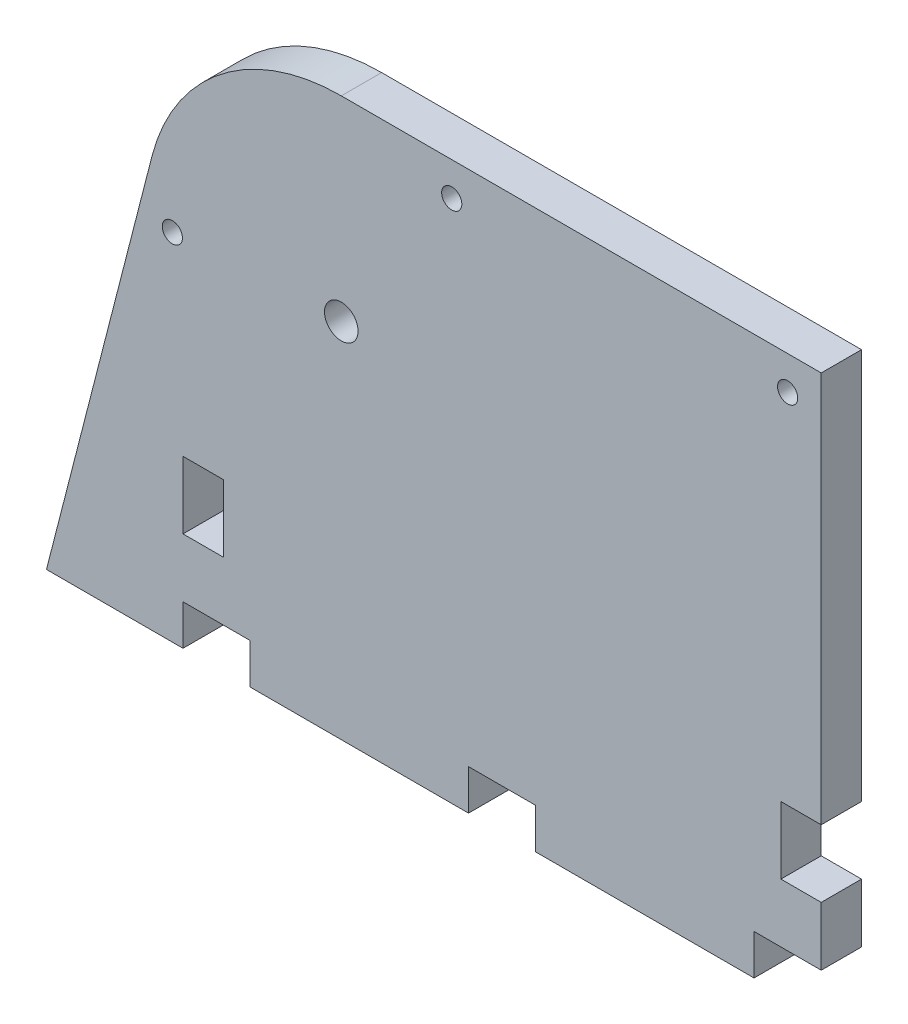
ISO-10303-21;
HEADER;
FILE_DESCRIPTION(('STEP AP214'),'2;1');
FILE_NAME('part.step','',(''),(''),'','','');
FILE_SCHEMA(('AUTOMOTIVE_DESIGN { 1 0 10303 214 1 1 1 1 }'));
ENDSEC;
DATA;
#1=APPLICATION_CONTEXT('core data for automotive mechanical design processes');
#2=APPLICATION_PROTOCOL_DEFINITION('international standard','automotive_design',2000,#1);
#3=PRODUCT_CONTEXT('',#1,'mechanical');
#4=PRODUCT('Part','Part','',(#3));
#5=PRODUCT_RELATED_PRODUCT_CATEGORY('part','',(#4));
#6=PRODUCT_DEFINITION_FORMATION('','',#4);
#7=PRODUCT_DEFINITION_CONTEXT('part definition',#1,'design');
#8=PRODUCT_DEFINITION('design','',#6,#7);
#9=PRODUCT_DEFINITION_SHAPE('','',#8);
#10=(LENGTH_UNIT() NAMED_UNIT(*) SI_UNIT(.MILLI.,.METRE.));
#11=(NAMED_UNIT(*) PLANE_ANGLE_UNIT() SI_UNIT($,.RADIAN.));
#12=(NAMED_UNIT(*) SI_UNIT($,.STERADIAN.) SOLID_ANGLE_UNIT());
#13=UNCERTAINTY_MEASURE_WITH_UNIT(LENGTH_MEASURE(1.E-05),#10,'distance_accuracy_value','');
#14=(GEOMETRIC_REPRESENTATION_CONTEXT(3) GLOBAL_UNCERTAINTY_ASSIGNED_CONTEXT((#13)) GLOBAL_UNIT_ASSIGNED_CONTEXT((#10,
#11,#12)) REPRESENTATION_CONTEXT('',''));
#15=CARTESIAN_POINT('',(0.,0.,0.));
#16=DIRECTION('',(0.,0.,1.));
#17=DIRECTION('',(1.,0.,0.));
#18=AXIS2_PLACEMENT_3D('',#15,#16,#17);
#19=CARTESIAN_POINT('',(105.,0.,6.));
#20=DIRECTION('',(0.,1.,0.));
#21=DIRECTION('',(-1.,0.,0.));
#22=AXIS2_PLACEMENT_3D('',#19,#20,#21);
#23=PLANE('',#22);
#24=DIRECTION('',(1.,0.,0.));
#25=VECTOR('',#24,1.);
#26=CARTESIAN_POINT('',(105.,0.,0.));
#27=LINE('',#26,#25);
#28=CARTESIAN_POINT('',(20.,0.,0.));
#29=VERTEX_POINT('',#28);
#30=CARTESIAN_POINT('',(52.5,0.,0.));
#31=VERTEX_POINT('',#30);
#32=EDGE_CURVE('E210',#29,#31,#27,.T.);
#33=ORIENTED_EDGE('',*,*,#32,.T.);
#34=DIRECTION('',(0.,0.,1.));
#35=VECTOR('',#34,1.);
#36=CARTESIAN_POINT('',(52.5,0.,0.));
#37=LINE('',#36,#35);
#38=CARTESIAN_POINT('',(52.5,0.,6.));
#39=VERTEX_POINT('',#38);
#40=EDGE_CURVE('E190',#31,#39,#37,.T.);
#41=ORIENTED_EDGE('',*,*,#40,.T.);
#42=DIRECTION('',(1.,0.,0.));
#43=VECTOR('',#42,1.);
#44=CARTESIAN_POINT('',(105.,0.,6.));
#45=LINE('',#44,#43);
#46=CARTESIAN_POINT('',(20.,0.,6.));
#47=VERTEX_POINT('',#46);
#48=EDGE_CURVE('E273',#47,#39,#45,.T.);
#49=ORIENTED_EDGE('',*,*,#48,.F.);
#50=DIRECTION('',(0.,0.,1.));
#51=VECTOR('',#50,1.);
#52=CARTESIAN_POINT('',(20.,0.,0.));
#53=LINE('',#52,#51);
#54=EDGE_CURVE('E217',#29,#47,#53,.T.);
#55=ORIENTED_EDGE('',*,*,#54,.F.);
#56=EDGE_LOOP('',(#33,#41,#49,#55));
#57=FACE_BOUND('',#56,.T.);
#58=ADVANCED_FACE('F34',(#57),#23,.F.);
#59=CARTESIAN_POINT('',(-10.3247928552616,0.,0.));
#60=VERTEX_POINT('',#59);
#61=CARTESIAN_POINT('',(10.,0.,0.));
#62=VERTEX_POINT('',#61);
#63=EDGE_CURVE('E218',#60,#62,#27,.T.);
#64=ORIENTED_EDGE('',*,*,#63,.T.);
#65=DIRECTION('',(0.,0.,1.));
#66=VECTOR('',#65,1.);
#67=CARTESIAN_POINT('',(10.,0.,0.));
#68=LINE('',#67,#66);
#69=CARTESIAN_POINT('',(10.,0.,6.));
#70=VERTEX_POINT('',#69);
#71=EDGE_CURVE('E269',#62,#70,#68,.T.);
#72=ORIENTED_EDGE('',*,*,#71,.T.);
#73=CARTESIAN_POINT('',(-10.3247928552616,0.,6.));
#74=VERTEX_POINT('',#73);
#75=EDGE_CURVE('E268',#74,#70,#45,.T.);
#76=ORIENTED_EDGE('',*,*,#75,.F.);
#77=DIRECTION('',(0.,0.,-1.));
#78=VECTOR('',#77,1.);
#79=CARTESIAN_POINT('',(-10.3247928552616,0.,6.));
#80=LINE('',#79,#78);
#81=EDGE_CURVE('E239',#74,#60,#80,.T.);
#82=ORIENTED_EDGE('',*,*,#81,.T.);
#83=EDGE_LOOP('',(#64,#72,#76,#82));
#84=FACE_BOUND('',#83,.T.);
#85=ADVANCED_FACE('F265',(#84),#23,.F.);
#86=CARTESIAN_POINT('',(105.,83.,6.));
#87=DIRECTION('',(-1.,0.,0.));
#88=DIRECTION('',(0.,-1.,0.));
#89=AXIS2_PLACEMENT_3D('',#86,#87,#88);
#90=PLANE('',#89);
#91=DIRECTION('',(0.,1.,0.));
#92=VECTOR('',#91,1.);
#93=CARTESIAN_POINT('',(105.,83.,0.));
#94=LINE('',#93,#92);
#95=CARTESIAN_POINT('',(105.,6.00000000000002,0.));
#96=VERTEX_POINT('',#95);
#97=CARTESIAN_POINT('',(105.,14.75,0.));
#98=VERTEX_POINT('',#97);
#99=EDGE_CURVE('E230',#96,#98,#94,.T.);
#100=ORIENTED_EDGE('',*,*,#99,.T.);
#101=DIRECTION('',(0.,0.,1.));
#102=VECTOR('',#101,1.);
#103=CARTESIAN_POINT('',(105.,14.75,0.));
#104=LINE('',#103,#102);
#105=CARTESIAN_POINT('',(105.,14.75,6.));
#106=VERTEX_POINT('',#105);
#107=EDGE_CURVE('E326',#98,#106,#104,.T.);
#108=ORIENTED_EDGE('',*,*,#107,.T.);
#109=DIRECTION('',(0.,1.,0.));
#110=VECTOR('',#109,1.);
#111=CARTESIAN_POINT('',(105.,83.,6.));
#112=LINE('',#111,#110);
#113=CARTESIAN_POINT('',(105.,6.,6.));
#114=VERTEX_POINT('',#113);
#115=EDGE_CURVE('E275',#114,#106,#112,.T.);
#116=ORIENTED_EDGE('',*,*,#115,.F.);
#117=DIRECTION('',(0.,0.,1.));
#118=VECTOR('',#117,1.);
#119=CARTESIAN_POINT('',(105.,6.,0.));
#120=LINE('',#119,#118);
#121=EDGE_CURVE('E298',#96,#114,#120,.T.);
#122=ORIENTED_EDGE('',*,*,#121,.F.);
#123=EDGE_LOOP('',(#100,#108,#116,#122));
#124=FACE_BOUND('',#123,.T.);
#125=ADVANCED_FACE('F407',(#124),#90,.F.);
#126=CARTESIAN_POINT('',(33.5613886077065,53.9097221037271,6.));
#127=DIRECTION('',(0.,0.,-1.));
#128=DIRECTION('',(-1.,0.,0.));
#129=AXIS2_PLACEMENT_3D('',#126,#127,#128);
#130=PLANE('',#129);
#131=CARTESIAN_POINT('',(8.41486022586607,52.8440056136108,6.));
#132=DIRECTION('',(0.,0.,-1.));
#133=DIRECTION('',(-1.,0.,0.));
#134=AXIS2_PLACEMENT_3D('',#131,#132,#133);
#135=CIRCLE('',#134,1.5);
#136=CARTESIAN_POINT('',(9.91486022586607,52.8440056136108,6.));
#137=VERTEX_POINT('',#136);
#138=EDGE_CURVE('E473',#137,#137,#135,.F.);
#139=ORIENTED_EDGE('',*,*,#138,.F.);
#140=EDGE_LOOP('',(#139));
#141=FACE_BOUND('',#140,.T.);
#142=CARTESIAN_POINT('',(50.,78.,6.));
#143=DIRECTION('',(0.,0.,1.));
#144=DIRECTION('',(1.,0.,0.));
#145=AXIS2_PLACEMENT_3D('',#142,#143,#144);
#146=CIRCLE('',#145,1.5);
#147=CARTESIAN_POINT('',(51.5,78.,6.));
#148=VERTEX_POINT('',#147);
#149=EDGE_CURVE('E476',#148,#148,#146,.T.);
#150=ORIENTED_EDGE('',*,*,#149,.F.);
#151=EDGE_LOOP('',(#150));
#152=FACE_BOUND('',#151,.T.);
#153=CARTESIAN_POINT('',(100.,78.,6.));
#154=DIRECTION('',(0.,0.,1.));
#155=DIRECTION('',(1.,0.,0.));
#156=AXIS2_PLACEMENT_3D('',#153,#154,#155);
#157=CIRCLE('',#156,1.5);
#158=CARTESIAN_POINT('',(101.5,78.,6.));
#159=VERTEX_POINT('',#158);
#160=EDGE_CURVE('E469',#159,#159,#157,.T.);
#161=ORIENTED_EDGE('',*,*,#160,.F.);
#162=EDGE_LOOP('',(#161));
#163=FACE_BOUND('',#162,.T.);
#164=DIRECTION('',(1.,0.,0.));
#165=VECTOR('',#164,1.);
#166=CARTESIAN_POINT('',(10.,14.75,6.));
#167=LINE('',#166,#165);
#168=CARTESIAN_POINT('',(10.,14.75,6.));
#169=VERTEX_POINT('',#168);
#170=CARTESIAN_POINT('',(16.,14.75,6.));
#171=VERTEX_POINT('',#170);
#172=EDGE_CURVE('E347',#169,#171,#167,.T.);
#173=ORIENTED_EDGE('',*,*,#172,.F.);
#174=DIRECTION('',(0.,-1.,0.));
#175=VECTOR('',#174,1.);
#176=CARTESIAN_POINT('',(10.,14.75,6.));
#177=LINE('',#176,#175);
#178=CARTESIAN_POINT('',(10.,24.75,6.));
#179=VERTEX_POINT('',#178);
#180=EDGE_CURVE('E50',#179,#169,#177,.T.);
#181=ORIENTED_EDGE('',*,*,#180,.F.);
#182=DIRECTION('',(-1.,0.,0.));
#183=VECTOR('',#182,1.);
#184=CARTESIAN_POINT('',(10.,24.75,6.));
#185=LINE('',#184,#183);
#186=CARTESIAN_POINT('',(16.,24.75,6.));
#187=VERTEX_POINT('',#186);
#188=EDGE_CURVE('E338',#187,#179,#185,.T.);
#189=ORIENTED_EDGE('',*,*,#188,.F.);
#190=DIRECTION('',(0.,1.,0.));
#191=VECTOR('',#190,1.);
#192=CARTESIAN_POINT('',(16.,14.75,6.));
#193=LINE('',#192,#191);
#194=EDGE_CURVE('E351',#171,#187,#193,.T.);
#195=ORIENTED_EDGE('',*,*,#194,.F.);
#196=EDGE_LOOP('',(#173,#181,#189,#195));
#197=FACE_BOUND('',#196,.T.);
#198=ORIENTED_EDGE('',*,*,#115,.T.);
#199=DIRECTION('',(1.,0.,0.));
#200=VECTOR('',#199,1.);
#201=CARTESIAN_POINT('',(105.,14.75,6.));
#202=LINE('',#201,#200);
#203=CARTESIAN_POINT('',(99.,14.75,6.));
#204=VERTEX_POINT('',#203);
#205=EDGE_CURVE('E312',#204,#106,#202,.T.);
#206=ORIENTED_EDGE('',*,*,#205,.F.);
#207=DIRECTION('',(0.,-1.,0.));
#208=VECTOR('',#207,1.);
#209=CARTESIAN_POINT('',(99.,24.75,6.));
#210=LINE('',#209,#208);
#211=CARTESIAN_POINT('',(99.,24.75,6.));
#212=VERTEX_POINT('',#211);
#213=EDGE_CURVE('E321',#212,#204,#210,.T.);
#214=ORIENTED_EDGE('',*,*,#213,.F.);
#215=DIRECTION('',(-1.,0.,0.));
#216=VECTOR('',#215,1.);
#217=CARTESIAN_POINT('',(105.,24.75,6.));
#218=LINE('',#217,#216);
#219=CARTESIAN_POINT('',(105.,24.75,6.));
#220=VERTEX_POINT('',#219);
#221=EDGE_CURVE('E318',#220,#212,#218,.T.);
#222=ORIENTED_EDGE('',*,*,#221,.F.);
#223=CARTESIAN_POINT('',(105.,83.,6.));
#224=VERTEX_POINT('',#223);
#225=EDGE_CURVE('E272',#220,#224,#112,.T.);
#226=ORIENTED_EDGE('',*,*,#225,.T.);
#227=DIRECTION('',(-1.,0.,0.));
#228=VECTOR('',#227,1.);
#229=CARTESIAN_POINT('',(33.5613886077065,83.,6.));
#230=LINE('',#229,#228);
#231=CARTESIAN_POINT('',(33.5613886077065,83.,6.));
#232=VERTEX_POINT('',#231);
#233=EDGE_CURVE('E431',#224,#232,#230,.T.);
#234=ORIENTED_EDGE('',*,*,#233,.T.);
#235=CARTESIAN_POINT('',(33.5613886077065,53.9097221037271,6.));
#236=DIRECTION('',(0.,0.,1.));
#237=DIRECTION('',(-1.,0.,0.));
#238=AXIS2_PLACEMENT_3D('',#235,#236,#237);
#239=CIRCLE('',#238,29.0902778962729);
#240=CARTESIAN_POINT('',(5.38622005558548,61.1487928411874,6.));
#241=VERTEX_POINT('',#240);
#242=EDGE_CURVE('E252',#232,#241,#239,.T.);
#243=ORIENTED_EDGE('',*,*,#242,.T.);
#244=DIRECTION('',(-0.248848455943689,-0.968542433750035,0.));
#245=VECTOR('',#244,1.);
#246=CARTESIAN_POINT('',(-9.68542433750036,2.48848455943689,6.));
#247=LINE('',#246,#245);
#248=EDGE_CURVE('E227',#241,#74,#247,.T.);
#249=ORIENTED_EDGE('',*,*,#248,.T.);
#250=ORIENTED_EDGE('',*,*,#75,.T.);
#251=DIRECTION('',(0.,-1.,0.));
#252=VECTOR('',#251,1.);
#253=CARTESIAN_POINT('',(10.,0.,6.));
#254=LINE('',#253,#252);
#255=CARTESIAN_POINT('',(10.,6.,6.));
#256=VERTEX_POINT('',#255);
#257=EDGE_CURVE('E370',#256,#70,#254,.T.);
#258=ORIENTED_EDGE('',*,*,#257,.F.);
#259=DIRECTION('',(-1.,0.,0.));
#260=VECTOR('',#259,1.);
#261=CARTESIAN_POINT('',(10.,6.,6.));
#262=LINE('',#261,#260);
#263=CARTESIAN_POINT('',(20.,6.,6.));
#264=VERTEX_POINT('',#263);
#265=EDGE_CURVE('E365',#264,#256,#262,.T.);
#266=ORIENTED_EDGE('',*,*,#265,.F.);
#267=DIRECTION('',(0.,1.,0.));
#268=VECTOR('',#267,1.);
#269=CARTESIAN_POINT('',(20.,0.,6.));
#270=LINE('',#269,#268);
#271=EDGE_CURVE('E372',#47,#264,#270,.T.);
#272=ORIENTED_EDGE('',*,*,#271,.F.);
#273=ORIENTED_EDGE('',*,*,#48,.T.);
#274=DIRECTION('',(0.,-1.,0.));
#275=VECTOR('',#274,1.);
#276=CARTESIAN_POINT('',(52.5,0.,6.));
#277=LINE('',#276,#275);
#278=CARTESIAN_POINT('',(52.5,6.,6.));
#279=VERTEX_POINT('',#278);
#280=EDGE_CURVE('E196',#279,#39,#277,.T.);
#281=ORIENTED_EDGE('',*,*,#280,.F.);
#282=DIRECTION('',(-1.,0.,0.));
#283=VECTOR('',#282,1.);
#284=CARTESIAN_POINT('',(52.5,6.,6.));
#285=LINE('',#284,#283);
#286=CARTESIAN_POINT('',(62.5,6.,6.));
#287=VERTEX_POINT('',#286);
#288=EDGE_CURVE('E214',#287,#279,#285,.T.);
#289=ORIENTED_EDGE('',*,*,#288,.F.);
#290=DIRECTION('',(0.,1.,0.));
#291=VECTOR('',#290,1.);
#292=CARTESIAN_POINT('',(62.5,0.,6.));
#293=LINE('',#292,#291);
#294=CARTESIAN_POINT('',(62.5,0.,6.));
#295=VERTEX_POINT('',#294);
#296=EDGE_CURVE('E289',#295,#287,#293,.T.);
#297=ORIENTED_EDGE('',*,*,#296,.F.);
#298=CARTESIAN_POINT('',(95.,0.,6.));
#299=VERTEX_POINT('',#298);
#300=EDGE_CURVE('E238',#295,#299,#45,.T.);
#301=ORIENTED_EDGE('',*,*,#300,.T.);
#302=DIRECTION('',(0.,-1.,0.));
#303=VECTOR('',#302,1.);
#304=CARTESIAN_POINT('',(95.,0.,6.));
#305=LINE('',#304,#303);
#306=CARTESIAN_POINT('',(95.,6.,6.));
#307=VERTEX_POINT('',#306);
#308=EDGE_CURVE('E286',#307,#299,#305,.T.);
#309=ORIENTED_EDGE('',*,*,#308,.F.);
#310=DIRECTION('',(-1.,0.,0.));
#311=VECTOR('',#310,1.);
#312=CARTESIAN_POINT('',(95.,6.,6.));
#313=LINE('',#312,#311);
#314=EDGE_CURVE('E452',#114,#307,#313,.T.);
#315=ORIENTED_EDGE('',*,*,#314,.F.);
#316=EDGE_LOOP('',(#198,#206,#214,#222,#226,#234,#243,#249,#250,#258,#266,#272,#273,#281,#289,
#297,#301,#309,#315));
#317=FACE_BOUND('',#316,.T.);
#318=CARTESIAN_POINT('',(33.5613886077065,53.9097221037271,6.));
#319=DIRECTION('',(0.,0.,1.));
#320=DIRECTION('',(1.,0.,0.));
#321=AXIS2_PLACEMENT_3D('',#318,#319,#320);
#322=CIRCLE('',#321,2.5);
#323=CARTESIAN_POINT('',(36.0613886077065,53.9097221037271,6.));
#324=VERTEX_POINT('',#323);
#325=EDGE_CURVE('E224',#324,#324,#322,.T.);
#326=ORIENTED_EDGE('',*,*,#325,.F.);
#327=EDGE_LOOP('',(#326));
#328=FACE_BOUND('',#327,.T.);
#329=ADVANCED_FACE('F283',(#141,#152,#163,#197,#317,#328),#130,.F.);
#330=CARTESIAN_POINT('',(33.5613886077065,53.9097221037271,0.));
#331=DIRECTION('',(0.,0.,-1.));
#332=DIRECTION('',(-1.,0.,0.));
#333=AXIS2_PLACEMENT_3D('',#330,#331,#332);
#334=PLANE('',#333);
#335=CARTESIAN_POINT('',(8.41486022586607,52.8440056136108,0.));
#336=DIRECTION('',(0.,0.,-1.));
#337=DIRECTION('',(-1.,0.,0.));
#338=AXIS2_PLACEMENT_3D('',#335,#336,#337);
#339=CIRCLE('',#338,1.5);
#340=CARTESIAN_POINT('',(9.91486022586607,52.8440056136108,0.));
#341=VERTEX_POINT('',#340);
#342=EDGE_CURVE('E38',#341,#341,#339,.F.);
#343=ORIENTED_EDGE('',*,*,#342,.T.);
#344=EDGE_LOOP('',(#343));
#345=FACE_BOUND('',#344,.T.);
#346=CARTESIAN_POINT('',(50.,78.,0.));
#347=DIRECTION('',(0.,0.,1.));
#348=DIRECTION('',(1.,0.,0.));
#349=AXIS2_PLACEMENT_3D('',#346,#347,#348);
#350=CIRCLE('',#349,1.5);
#351=CARTESIAN_POINT('',(51.5,78.,0.));
#352=VERTEX_POINT('',#351);
#353=EDGE_CURVE('E348',#352,#352,#350,.T.);
#354=ORIENTED_EDGE('',*,*,#353,.T.);
#355=EDGE_LOOP('',(#354));
#356=FACE_BOUND('',#355,.T.);
#357=CARTESIAN_POINT('',(100.,78.,0.));
#358=DIRECTION('',(0.,0.,1.));
#359=DIRECTION('',(1.,0.,0.));
#360=AXIS2_PLACEMENT_3D('',#357,#358,#359);
#361=CIRCLE('',#360,1.5);
#362=CARTESIAN_POINT('',(101.5,78.,0.));
#363=VERTEX_POINT('',#362);
#364=EDGE_CURVE('E472',#363,#363,#361,.T.);
#365=ORIENTED_EDGE('',*,*,#364,.T.);
#366=EDGE_LOOP('',(#365));
#367=FACE_BOUND('',#366,.T.);
#368=DIRECTION('',(0.,-1.,0.));
#369=VECTOR('',#368,1.);
#370=CARTESIAN_POINT('',(10.,14.75,0.));
#371=LINE('',#370,#369);
#372=CARTESIAN_POINT('',(10.,24.75,0.));
#373=VERTEX_POINT('',#372);
#374=CARTESIAN_POINT('',(10.,14.75,0.));
#375=VERTEX_POINT('',#374);
#376=EDGE_CURVE('E334',#373,#375,#371,.T.);
#377=ORIENTED_EDGE('',*,*,#376,.T.);
#378=DIRECTION('',(1.,0.,0.));
#379=VECTOR('',#378,1.);
#380=CARTESIAN_POINT('',(10.,14.75,0.));
#381=LINE('',#380,#379);
#382=CARTESIAN_POINT('',(16.,14.75,0.));
#383=VERTEX_POINT('',#382);
#384=EDGE_CURVE('E337',#375,#383,#381,.T.);
#385=ORIENTED_EDGE('',*,*,#384,.T.);
#386=DIRECTION('',(0.,1.,0.));
#387=VECTOR('',#386,1.);
#388=CARTESIAN_POINT('',(16.,14.75,0.));
#389=LINE('',#388,#387);
#390=CARTESIAN_POINT('',(16.,24.75,0.));
#391=VERTEX_POINT('',#390);
#392=EDGE_CURVE('E58',#383,#391,#389,.T.);
#393=ORIENTED_EDGE('',*,*,#392,.T.);
#394=DIRECTION('',(-1.,0.,0.));
#395=VECTOR('',#394,1.);
#396=CARTESIAN_POINT('',(10.,24.75,0.));
#397=LINE('',#396,#395);
#398=EDGE_CURVE('E342',#391,#373,#397,.T.);
#399=ORIENTED_EDGE('',*,*,#398,.T.);
#400=EDGE_LOOP('',(#377,#385,#393,#399));
#401=FACE_BOUND('',#400,.T.);
#402=DIRECTION('',(1.,0.,0.));
#403=VECTOR('',#402,1.);
#404=CARTESIAN_POINT('',(105.,14.75,0.));
#405=LINE('',#404,#403);
#406=CARTESIAN_POINT('',(99.,14.75,0.));
#407=VERTEX_POINT('',#406);
#408=EDGE_CURVE('E315',#407,#98,#405,.T.);
#409=ORIENTED_EDGE('',*,*,#408,.T.);
#410=ORIENTED_EDGE('',*,*,#99,.F.);
#411=DIRECTION('',(-1.,0.,0.));
#412=VECTOR('',#411,1.);
#413=CARTESIAN_POINT('',(95.,6.,0.));
#414=LINE('',#413,#412);
#415=CARTESIAN_POINT('',(95.,6.,0.));
#416=VERTEX_POINT('',#415);
#417=EDGE_CURVE('E299',#96,#416,#414,.T.);
#418=ORIENTED_EDGE('',*,*,#417,.T.);
#419=DIRECTION('',(0.,-1.,0.));
#420=VECTOR('',#419,1.);
#421=CARTESIAN_POINT('',(95.,0.,0.));
#422=LINE('',#421,#420);
#423=CARTESIAN_POINT('',(95.,0.,0.));
#424=VERTEX_POINT('',#423);
#425=EDGE_CURVE('E304',#416,#424,#422,.T.);
#426=ORIENTED_EDGE('',*,*,#425,.T.);
#427=CARTESIAN_POINT('',(62.5,0.,0.));
#428=VERTEX_POINT('',#427);
#429=EDGE_CURVE('E219',#428,#424,#27,.T.);
#430=ORIENTED_EDGE('',*,*,#429,.F.);
#431=DIRECTION('',(0.,1.,0.));
#432=VECTOR('',#431,1.);
#433=CARTESIAN_POINT('',(62.5,0.,0.));
#434=LINE('',#433,#432);
#435=CARTESIAN_POINT('',(62.5,6.,0.));
#436=VERTEX_POINT('',#435);
#437=EDGE_CURVE('E213',#428,#436,#434,.T.);
#438=ORIENTED_EDGE('',*,*,#437,.T.);
#439=DIRECTION('',(-1.,0.,0.));
#440=VECTOR('',#439,1.);
#441=CARTESIAN_POINT('',(52.5,6.,0.));
#442=LINE('',#441,#440);
#443=CARTESIAN_POINT('',(52.5,6.,0.));
#444=VERTEX_POINT('',#443);
#445=EDGE_CURVE('E202',#436,#444,#442,.T.);
#446=ORIENTED_EDGE('',*,*,#445,.T.);
#447=DIRECTION('',(0.,-1.,0.));
#448=VECTOR('',#447,1.);
#449=CARTESIAN_POINT('',(52.5,0.,0.));
#450=LINE('',#449,#448);
#451=EDGE_CURVE('E193',#444,#31,#450,.T.);
#452=ORIENTED_EDGE('',*,*,#451,.T.);
#453=ORIENTED_EDGE('',*,*,#32,.F.);
#454=DIRECTION('',(0.,1.,0.));
#455=VECTOR('',#454,1.);
#456=CARTESIAN_POINT('',(20.,0.,0.));
#457=LINE('',#456,#455);
#458=CARTESIAN_POINT('',(20.,6.,0.));
#459=VERTEX_POINT('',#458);
#460=EDGE_CURVE('E364',#29,#459,#457,.T.);
#461=ORIENTED_EDGE('',*,*,#460,.T.);
#462=DIRECTION('',(-1.,0.,0.));
#463=VECTOR('',#462,1.);
#464=CARTESIAN_POINT('',(10.,6.,0.));
#465=LINE('',#464,#463);
#466=CARTESIAN_POINT('',(10.,6.,0.));
#467=VERTEX_POINT('',#466);
#468=EDGE_CURVE('E367',#459,#467,#465,.T.);
#469=ORIENTED_EDGE('',*,*,#468,.T.);
#470=DIRECTION('',(0.,-1.,0.));
#471=VECTOR('',#470,1.);
#472=CARTESIAN_POINT('',(10.,0.,0.));
#473=LINE('',#472,#471);
#474=EDGE_CURVE('E362',#467,#62,#473,.T.);
#475=ORIENTED_EDGE('',*,*,#474,.T.);
#476=ORIENTED_EDGE('',*,*,#63,.F.);
#477=DIRECTION('',(-0.24884845594369,-0.968542433750035,0.));
#478=VECTOR('',#477,1.);
#479=CARTESIAN_POINT('',(-9.68542433750036,2.48848455943689,0.));
#480=LINE('',#479,#478);
#481=CARTESIAN_POINT('',(5.38622005558548,61.1487928411874,0.));
#482=VERTEX_POINT('',#481);
#483=EDGE_CURVE('E236',#482,#60,#480,.T.);
#484=ORIENTED_EDGE('',*,*,#483,.F.);
#485=CARTESIAN_POINT('',(33.5613886077065,53.9097221037271,0.));
#486=DIRECTION('',(0.,0.,1.));
#487=DIRECTION('',(-1.,0.,0.));
#488=AXIS2_PLACEMENT_3D('',#485,#486,#487);
#489=CIRCLE('',#488,29.0902778962729);
#490=CARTESIAN_POINT('',(33.5613886077065,83.,0.));
#491=VERTEX_POINT('',#490);
#492=EDGE_CURVE('E233',#491,#482,#489,.T.);
#493=ORIENTED_EDGE('',*,*,#492,.F.);
#494=DIRECTION('',(-1.,0.,0.));
#495=VECTOR('',#494,1.);
#496=CARTESIAN_POINT('',(33.5613886077065,83.,0.));
#497=LINE('',#496,#495);
#498=CARTESIAN_POINT('',(105.,83.,0.));
#499=VERTEX_POINT('',#498);
#500=EDGE_CURVE('E231',#499,#491,#497,.T.);
#501=ORIENTED_EDGE('',*,*,#500,.F.);
#502=CARTESIAN_POINT('',(105.,24.75,0.));
#503=VERTEX_POINT('',#502);
#504=EDGE_CURVE('E222',#503,#499,#94,.T.);
#505=ORIENTED_EDGE('',*,*,#504,.F.);
#506=DIRECTION('',(-1.,0.,0.));
#507=VECTOR('',#506,1.);
#508=CARTESIAN_POINT('',(105.,24.75,0.));
#509=LINE('',#508,#507);
#510=CARTESIAN_POINT('',(99.,24.75,0.));
#511=VERTEX_POINT('',#510);
#512=EDGE_CURVE('E308',#503,#511,#509,.T.);
#513=ORIENTED_EDGE('',*,*,#512,.T.);
#514=DIRECTION('',(0.,-1.,0.));
#515=VECTOR('',#514,1.);
#516=CARTESIAN_POINT('',(99.,24.75,0.));
#517=LINE('',#516,#515);
#518=EDGE_CURVE('E311',#511,#407,#517,.T.);
#519=ORIENTED_EDGE('',*,*,#518,.T.);
#520=EDGE_LOOP('',(#409,#410,#418,#426,#430,#438,#446,#452,#453,#461,#469,#475,#476,#484,#493,
#501,#505,#513,#519));
#521=FACE_BOUND('',#520,.T.);
#522=CARTESIAN_POINT('',(33.5613886077065,53.9097221037271,0.));
#523=DIRECTION('',(0.,0.,1.));
#524=DIRECTION('',(1.,0.,0.));
#525=AXIS2_PLACEMENT_3D('',#522,#523,#524);
#526=CIRCLE('',#525,2.5);
#527=CARTESIAN_POINT('',(36.0613886077065,53.9097221037271,0.));
#528=VERTEX_POINT('',#527);
#529=EDGE_CURVE('E380',#528,#528,#526,.T.);
#530=ORIENTED_EDGE('',*,*,#529,.T.);
#531=EDGE_LOOP('',(#530));
#532=FACE_BOUND('',#531,.T.);
#533=ADVANCED_FACE('F207',(#345,#356,#367,#401,#521,#532),#334,.T.);
#534=ORIENTED_EDGE('',*,*,#429,.T.);
#535=DIRECTION('',(0.,0.,1.));
#536=VECTOR('',#535,1.);
#537=CARTESIAN_POINT('',(95.,0.,0.));
#538=LINE('',#537,#536);
#539=EDGE_CURVE('E294',#424,#299,#538,.T.);
#540=ORIENTED_EDGE('',*,*,#539,.T.);
#541=ORIENTED_EDGE('',*,*,#300,.F.);
#542=DIRECTION('',(0.,0.,1.));
#543=VECTOR('',#542,1.);
#544=CARTESIAN_POINT('',(62.5,0.,0.));
#545=LINE('',#544,#543);
#546=EDGE_CURVE('E201',#428,#295,#545,.T.);
#547=ORIENTED_EDGE('',*,*,#546,.F.);
#548=EDGE_LOOP('',(#534,#540,#541,#547));
#549=FACE_BOUND('',#548,.T.);
#550=ADVANCED_FACE('F36',(#549),#23,.F.);
#551=ORIENTED_EDGE('',*,*,#225,.F.);
#552=DIRECTION('',(0.,0.,1.));
#553=VECTOR('',#552,1.);
#554=CARTESIAN_POINT('',(105.,24.75,0.));
#555=LINE('',#554,#553);
#556=EDGE_CURVE('E317',#503,#220,#555,.T.);
#557=ORIENTED_EDGE('',*,*,#556,.F.);
#558=ORIENTED_EDGE('',*,*,#504,.T.);
#559=DIRECTION('',(0.,0.,-1.));
#560=VECTOR('',#559,1.);
#561=CARTESIAN_POINT('',(105.,83.,6.));
#562=LINE('',#561,#560);
#563=EDGE_CURVE('E11',#224,#499,#562,.T.);
#564=ORIENTED_EDGE('',*,*,#563,.F.);
#565=EDGE_LOOP('',(#551,#557,#558,#564));
#566=FACE_BOUND('',#565,.T.);
#567=ADVANCED_FACE('F409',(#566),#90,.F.);
#568=CARTESIAN_POINT('',(33.5613886077065,83.,6.));
#569=DIRECTION('',(0.,-1.,0.));
#570=DIRECTION('',(0.,0.,-1.));
#571=AXIS2_PLACEMENT_3D('',#568,#569,#570);
#572=PLANE('',#571);
#573=ORIENTED_EDGE('',*,*,#500,.T.);
#574=DIRECTION('',(0.,0.,-1.));
#575=VECTOR('',#574,1.);
#576=CARTESIAN_POINT('',(33.5613886077065,83.,6.));
#577=LINE('',#576,#575);
#578=EDGE_CURVE('E43',#232,#491,#577,.T.);
#579=ORIENTED_EDGE('',*,*,#578,.F.);
#580=ORIENTED_EDGE('',*,*,#233,.F.);
#581=ORIENTED_EDGE('',*,*,#563,.T.);
#582=EDGE_LOOP('',(#573,#579,#580,#581));
#583=FACE_BOUND('',#582,.T.);
#584=ADVANCED_FACE('F414',(#583),#572,.F.);
#585=CARTESIAN_POINT('',(33.5613886077065,53.9097221037271,6.));
#586=DIRECTION('',(0.,0.,-1.));
#587=DIRECTION('',(-1.,0.,0.));
#588=AXIS2_PLACEMENT_3D('',#585,#586,#587);
#589=CYLINDRICAL_SURFACE('',#588,29.0902778962729);
#590=ORIENTED_EDGE('',*,*,#492,.T.);
#591=DIRECTION('',(0.,0.,-1.));
#592=VECTOR('',#591,1.);
#593=CARTESIAN_POINT('',(5.38622005558548,61.1487928411874,6.));
#594=LINE('',#593,#592);
#595=EDGE_CURVE('E242',#241,#482,#594,.T.);
#596=ORIENTED_EDGE('',*,*,#595,.F.);
#597=ORIENTED_EDGE('',*,*,#242,.F.);
#598=ORIENTED_EDGE('',*,*,#578,.T.);
#599=EDGE_LOOP('',(#590,#596,#597,#598));
#600=FACE_BOUND('',#599,.T.);
#601=ADVANCED_FACE('F250',(#600),#589,.T.);
#602=CARTESIAN_POINT('',(-9.68542433750036,2.48848455943689,6.));
#603=DIRECTION('',(0.968542433750035,-0.24884845594369,0.));
#604=DIRECTION('',(0.24884845594369,0.968542433750035,0.));
#605=AXIS2_PLACEMENT_3D('',#602,#603,#604);
#606=PLANE('',#605);
#607=ORIENTED_EDGE('',*,*,#483,.T.);
#608=ORIENTED_EDGE('',*,*,#81,.F.);
#609=ORIENTED_EDGE('',*,*,#248,.F.);
#610=ORIENTED_EDGE('',*,*,#595,.T.);
#611=EDGE_LOOP('',(#607,#608,#609,#610));
#612=FACE_BOUND('',#611,.T.);
#613=ADVANCED_FACE('F261',(#612),#606,.F.);
#614=CARTESIAN_POINT('',(33.5613886077065,53.9097221037271,6.));
#615=DIRECTION('',(0.,0.,-1.));
#616=DIRECTION('',(-1.,0.,0.));
#617=AXIS2_PLACEMENT_3D('',#614,#615,#616);
#618=CYLINDRICAL_SURFACE('',#617,2.5);
#619=ORIENTED_EDGE('',*,*,#325,.T.);
#620=EDGE_LOOP('',(#619));
#621=FACE_BOUND('',#620,.T.);
#622=ORIENTED_EDGE('',*,*,#529,.F.);
#623=EDGE_LOOP('',(#622));
#624=FACE_BOUND('',#623,.T.);
#625=ADVANCED_FACE('F389',(#621,#624),#618,.F.);
#626=CARTESIAN_POINT('',(95.,0.,0.));
#627=DIRECTION('',(-1.,0.,0.));
#628=DIRECTION('',(0.,0.,1.));
#629=AXIS2_PLACEMENT_3D('',#626,#627,#628);
#630=PLANE('',#629);
#631=ORIENTED_EDGE('',*,*,#308,.T.);
#632=ORIENTED_EDGE('',*,*,#539,.F.);
#633=ORIENTED_EDGE('',*,*,#425,.F.);
#634=DIRECTION('',(0.,0.,1.));
#635=VECTOR('',#634,1.);
#636=CARTESIAN_POINT('',(95.,6.,0.));
#637=LINE('',#636,#635);
#638=EDGE_CURVE('E301',#416,#307,#637,.T.);
#639=ORIENTED_EDGE('',*,*,#638,.T.);
#640=EDGE_LOOP('',(#631,#632,#633,#639));
#641=FACE_BOUND('',#640,.T.);
#642=ADVANCED_FACE('F391',(#641),#630,.F.);
#643=CARTESIAN_POINT('',(95.,6.,0.));
#644=DIRECTION('',(0.,1.,0.));
#645=DIRECTION('',(0.,0.,1.));
#646=AXIS2_PLACEMENT_3D('',#643,#644,#645);
#647=PLANE('',#646);
#648=ORIENTED_EDGE('',*,*,#314,.T.);
#649=ORIENTED_EDGE('',*,*,#638,.F.);
#650=ORIENTED_EDGE('',*,*,#417,.F.);
#651=ORIENTED_EDGE('',*,*,#121,.T.);
#652=EDGE_LOOP('',(#648,#649,#650,#651));
#653=FACE_BOUND('',#652,.T.);
#654=ADVANCED_FACE('F398',(#653),#647,.F.);
#655=CARTESIAN_POINT('',(105.,14.75,0.));
#656=DIRECTION('',(0.,-1.,0.));
#657=DIRECTION('',(0.,0.,-1.));
#658=AXIS2_PLACEMENT_3D('',#655,#656,#657);
#659=PLANE('',#658);
#660=ORIENTED_EDGE('',*,*,#205,.T.);
#661=ORIENTED_EDGE('',*,*,#107,.F.);
#662=ORIENTED_EDGE('',*,*,#408,.F.);
#663=DIRECTION('',(0.,0.,1.));
#664=VECTOR('',#663,1.);
#665=CARTESIAN_POINT('',(99.,14.75,0.));
#666=LINE('',#665,#664);
#667=EDGE_CURVE('E329',#407,#204,#666,.T.);
#668=ORIENTED_EDGE('',*,*,#667,.T.);
#669=EDGE_LOOP('',(#660,#661,#662,#668));
#670=FACE_BOUND('',#669,.T.);
#671=ADVANCED_FACE('F444',(#670),#659,.F.);
#672=CARTESIAN_POINT('',(99.,24.75,0.));
#673=DIRECTION('',(-1.,0.,0.));
#674=DIRECTION('',(0.,0.,1.));
#675=AXIS2_PLACEMENT_3D('',#672,#673,#674);
#676=PLANE('',#675);
#677=ORIENTED_EDGE('',*,*,#213,.T.);
#678=ORIENTED_EDGE('',*,*,#667,.F.);
#679=ORIENTED_EDGE('',*,*,#518,.F.);
#680=DIRECTION('',(0.,0.,1.));
#681=VECTOR('',#680,1.);
#682=CARTESIAN_POINT('',(99.,24.75,0.));
#683=LINE('',#682,#681);
#684=EDGE_CURVE('E331',#511,#212,#683,.T.);
#685=ORIENTED_EDGE('',*,*,#684,.T.);
#686=EDGE_LOOP('',(#677,#678,#679,#685));
#687=FACE_BOUND('',#686,.T.);
#688=ADVANCED_FACE('F440',(#687),#676,.F.);
#689=CARTESIAN_POINT('',(105.,24.75,0.));
#690=DIRECTION('',(0.,1.,0.));
#691=DIRECTION('',(0.,0.,1.));
#692=AXIS2_PLACEMENT_3D('',#689,#690,#691);
#693=PLANE('',#692);
#694=ORIENTED_EDGE('',*,*,#221,.T.);
#695=ORIENTED_EDGE('',*,*,#684,.F.);
#696=ORIENTED_EDGE('',*,*,#512,.F.);
#697=ORIENTED_EDGE('',*,*,#556,.T.);
#698=EDGE_LOOP('',(#694,#695,#696,#697));
#699=FACE_BOUND('',#698,.T.);
#700=ADVANCED_FACE('F436',(#699),#693,.F.);
#701=CARTESIAN_POINT('',(10.,0.,0.));
#702=DIRECTION('',(-1.,0.,0.));
#703=DIRECTION('',(0.,0.,1.));
#704=AXIS2_PLACEMENT_3D('',#701,#702,#703);
#705=PLANE('',#704);
#706=ORIENTED_EDGE('',*,*,#257,.T.);
#707=ORIENTED_EDGE('',*,*,#71,.F.);
#708=ORIENTED_EDGE('',*,*,#474,.F.);
#709=DIRECTION('',(0.,0.,1.));
#710=VECTOR('',#709,1.);
#711=CARTESIAN_POINT('',(10.,6.,0.));
#712=LINE('',#711,#710);
#713=EDGE_CURVE('E378',#467,#256,#712,.T.);
#714=ORIENTED_EDGE('',*,*,#713,.T.);
#715=EDGE_LOOP('',(#706,#707,#708,#714));
#716=FACE_BOUND('',#715,.T.);
#717=ADVANCED_FACE('F519',(#716),#705,.F.);
#718=CARTESIAN_POINT('',(10.,6.,0.));
#719=DIRECTION('',(0.,1.,0.));
#720=DIRECTION('',(-1.,0.,0.));
#721=AXIS2_PLACEMENT_3D('',#718,#719,#720);
#722=PLANE('',#721);
#723=ORIENTED_EDGE('',*,*,#265,.T.);
#724=ORIENTED_EDGE('',*,*,#713,.F.);
#725=ORIENTED_EDGE('',*,*,#468,.F.);
#726=DIRECTION('',(0.,0.,1.));
#727=VECTOR('',#726,1.);
#728=CARTESIAN_POINT('',(20.,6.,0.));
#729=LINE('',#728,#727);
#730=EDGE_CURVE('E381',#459,#264,#729,.T.);
#731=ORIENTED_EDGE('',*,*,#730,.T.);
#732=EDGE_LOOP('',(#723,#724,#725,#731));
#733=FACE_BOUND('',#732,.T.);
#734=ADVANCED_FACE('F532',(#733),#722,.F.);
#735=CARTESIAN_POINT('',(20.,0.,0.));
#736=DIRECTION('',(1.,0.,0.));
#737=DIRECTION('',(0.,1.,0.));
#738=AXIS2_PLACEMENT_3D('',#735,#736,#737);
#739=PLANE('',#738);
#740=ORIENTED_EDGE('',*,*,#271,.T.);
#741=ORIENTED_EDGE('',*,*,#730,.F.);
#742=ORIENTED_EDGE('',*,*,#460,.F.);
#743=ORIENTED_EDGE('',*,*,#54,.T.);
#744=EDGE_LOOP('',(#740,#741,#742,#743));
#745=FACE_BOUND('',#744,.T.);
#746=ADVANCED_FACE('F510',(#745),#739,.F.);
#747=CARTESIAN_POINT('',(52.5,0.,0.));
#748=DIRECTION('',(-1.,0.,0.));
#749=DIRECTION('',(0.,0.,1.));
#750=AXIS2_PLACEMENT_3D('',#747,#748,#749);
#751=PLANE('',#750);
#752=ORIENTED_EDGE('',*,*,#280,.T.);
#753=ORIENTED_EDGE('',*,*,#40,.F.);
#754=ORIENTED_EDGE('',*,*,#451,.F.);
#755=DIRECTION('',(0.,0.,1.));
#756=VECTOR('',#755,1.);
#757=CARTESIAN_POINT('',(52.5,6.,0.));
#758=LINE('',#757,#756);
#759=EDGE_CURVE('E373',#444,#279,#758,.T.);
#760=ORIENTED_EDGE('',*,*,#759,.T.);
#761=EDGE_LOOP('',(#752,#753,#754,#760));
#762=FACE_BOUND('',#761,.T.);
#763=ADVANCED_FACE('F192',(#762),#751,.F.);
#764=CARTESIAN_POINT('',(52.5,6.,0.));
#765=DIRECTION('',(0.,1.,0.));
#766=DIRECTION('',(-1.,0.,0.));
#767=AXIS2_PLACEMENT_3D('',#764,#765,#766);
#768=PLANE('',#767);
#769=ORIENTED_EDGE('',*,*,#288,.T.);
#770=ORIENTED_EDGE('',*,*,#759,.F.);
#771=ORIENTED_EDGE('',*,*,#445,.F.);
#772=DIRECTION('',(0.,0.,1.));
#773=VECTOR('',#772,1.);
#774=CARTESIAN_POINT('',(62.5,6.,0.));
#775=LINE('',#774,#773);
#776=EDGE_CURVE('E464',#436,#287,#775,.T.);
#777=ORIENTED_EDGE('',*,*,#776,.T.);
#778=EDGE_LOOP('',(#769,#770,#771,#777));
#779=FACE_BOUND('',#778,.T.);
#780=ADVANCED_FACE('F501',(#779),#768,.F.);
#781=CARTESIAN_POINT('',(62.5,0.,0.));
#782=DIRECTION('',(1.,0.,0.));
#783=DIRECTION('',(0.,0.,-1.));
#784=AXIS2_PLACEMENT_3D('',#781,#782,#783);
#785=PLANE('',#784);
#786=ORIENTED_EDGE('',*,*,#296,.T.);
#787=ORIENTED_EDGE('',*,*,#776,.F.);
#788=ORIENTED_EDGE('',*,*,#437,.F.);
#789=ORIENTED_EDGE('',*,*,#546,.T.);
#790=EDGE_LOOP('',(#786,#787,#788,#789));
#791=FACE_BOUND('',#790,.T.);
#792=ADVANCED_FACE('F467',(#791),#785,.F.);
#793=CARTESIAN_POINT('',(10.,14.75,0.));
#794=DIRECTION('',(-1.,0.,0.));
#795=DIRECTION('',(0.,0.,1.));
#796=AXIS2_PLACEMENT_3D('',#793,#794,#795);
#797=PLANE('',#796);
#798=ORIENTED_EDGE('',*,*,#180,.T.);
#799=DIRECTION('',(0.,0.,1.));
#800=VECTOR('',#799,1.);
#801=CARTESIAN_POINT('',(10.,14.75,0.));
#802=LINE('',#801,#800);
#803=EDGE_CURVE('E345',#375,#169,#802,.T.);
#804=ORIENTED_EDGE('',*,*,#803,.F.);
#805=ORIENTED_EDGE('',*,*,#376,.F.);
#806=DIRECTION('',(0.,0.,1.));
#807=VECTOR('',#806,1.);
#808=CARTESIAN_POINT('',(10.,24.75,0.));
#809=LINE('',#808,#807);
#810=EDGE_CURVE('E322',#373,#179,#809,.T.);
#811=ORIENTED_EDGE('',*,*,#810,.T.);
#812=EDGE_LOOP('',(#798,#804,#805,#811));
#813=FACE_BOUND('',#812,.T.);
#814=ADVANCED_FACE('F507',(#813),#797,.F.);
#815=CARTESIAN_POINT('',(10.,24.75,0.));
#816=DIRECTION('',(0.,1.,0.));
#817=DIRECTION('',(0.,0.,1.));
#818=AXIS2_PLACEMENT_3D('',#815,#816,#817);
#819=PLANE('',#818);
#820=ORIENTED_EDGE('',*,*,#188,.T.);
#821=ORIENTED_EDGE('',*,*,#810,.F.);
#822=ORIENTED_EDGE('',*,*,#398,.F.);
#823=DIRECTION('',(0.,0.,1.));
#824=VECTOR('',#823,1.);
#825=CARTESIAN_POINT('',(16.,24.75,0.));
#826=LINE('',#825,#824);
#827=EDGE_CURVE('E357',#391,#187,#826,.T.);
#828=ORIENTED_EDGE('',*,*,#827,.T.);
#829=EDGE_LOOP('',(#820,#821,#822,#828));
#830=FACE_BOUND('',#829,.T.);
#831=ADVANCED_FACE('F520',(#830),#819,.F.);
#832=CARTESIAN_POINT('',(16.,14.75,0.));
#833=DIRECTION('',(1.,0.,0.));
#834=DIRECTION('',(0.,0.,-1.));
#835=AXIS2_PLACEMENT_3D('',#832,#833,#834);
#836=PLANE('',#835);
#837=ORIENTED_EDGE('',*,*,#194,.T.);
#838=ORIENTED_EDGE('',*,*,#827,.F.);
#839=ORIENTED_EDGE('',*,*,#392,.F.);
#840=DIRECTION('',(0.,0.,1.));
#841=VECTOR('',#840,1.);
#842=CARTESIAN_POINT('',(16.,14.75,0.));
#843=LINE('',#842,#841);
#844=EDGE_CURVE('E359',#383,#171,#843,.T.);
#845=ORIENTED_EDGE('',*,*,#844,.T.);
#846=EDGE_LOOP('',(#837,#838,#839,#845));
#847=FACE_BOUND('',#846,.T.);
#848=ADVANCED_FACE('F523',(#847),#836,.F.);
#849=CARTESIAN_POINT('',(10.,14.75,0.));
#850=DIRECTION('',(0.,-1.,0.));
#851=DIRECTION('',(0.,0.,-1.));
#852=AXIS2_PLACEMENT_3D('',#849,#850,#851);
#853=PLANE('',#852);
#854=ORIENTED_EDGE('',*,*,#172,.T.);
#855=ORIENTED_EDGE('',*,*,#844,.F.);
#856=ORIENTED_EDGE('',*,*,#384,.F.);
#857=ORIENTED_EDGE('',*,*,#803,.T.);
#858=EDGE_LOOP('',(#854,#855,#856,#857));
#859=FACE_BOUND('',#858,.T.);
#860=ADVANCED_FACE('F499',(#859),#853,.F.);
#861=CARTESIAN_POINT('',(100.,78.,0.));
#862=DIRECTION('',(0.,0.,1.));
#863=DIRECTION('',(1.,0.,0.));
#864=AXIS2_PLACEMENT_3D('',#861,#862,#863);
#865=CYLINDRICAL_SURFACE('',#864,1.5);
#866=ORIENTED_EDGE('',*,*,#364,.F.);
#867=EDGE_LOOP('',(#866));
#868=FACE_BOUND('',#867,.T.);
#869=ORIENTED_EDGE('',*,*,#160,.T.);
#870=EDGE_LOOP('',(#869));
#871=FACE_BOUND('',#870,.T.);
#872=ADVANCED_FACE('F493',(#868,#871),#865,.F.);
#873=CARTESIAN_POINT('',(50.,78.,0.));
#874=DIRECTION('',(0.,0.,1.));
#875=DIRECTION('',(1.,0.,0.));
#876=AXIS2_PLACEMENT_3D('',#873,#874,#875);
#877=CYLINDRICAL_SURFACE('',#876,1.5);
#878=ORIENTED_EDGE('',*,*,#353,.F.);
#879=EDGE_LOOP('',(#878));
#880=FACE_BOUND('',#879,.T.);
#881=ORIENTED_EDGE('',*,*,#149,.T.);
#882=EDGE_LOOP('',(#881));
#883=FACE_BOUND('',#882,.T.);
#884=ADVANCED_FACE('F488',(#880,#883),#877,.F.);
#885=CARTESIAN_POINT('',(8.41486022586607,52.8440056136108,14.0000000056115));
#886=DIRECTION('',(0.,0.,-1.));
#887=DIRECTION('',(1.,0.,0.));
#888=AXIS2_PLACEMENT_3D('',#885,#886,#887);
#889=CYLINDRICAL_SURFACE('',#888,1.5);
#890=CARTESIAN_POINT('',(9.91486022586607,52.8440056136108,0.));
#891=CARTESIAN_POINT('',(9.91486022586607,52.8440056136108,0.0625000000000018));
#892=CARTESIAN_POINT('',(9.91486022586607,52.8440056136108,0.125000000000002));
#893=CARTESIAN_POINT('',(9.91486022586607,52.8440056136108,0.250000000000002));
#894=CARTESIAN_POINT('',(9.91486022586607,52.8440056136108,0.312500000000002));
#895=CARTESIAN_POINT('',(9.91486022586607,52.8440056136108,0.437500000000002));
#896=CARTESIAN_POINT('',(9.91486022586607,52.8440056136108,0.500000000000002));
#897=CARTESIAN_POINT('',(9.91486022586607,52.8440056136108,0.625000000000002));
#898=CARTESIAN_POINT('',(9.91486022586607,52.8440056136108,0.687500000000002));
#899=CARTESIAN_POINT('',(9.91486022586607,52.8440056136108,0.812500000000002));
#900=CARTESIAN_POINT('',(9.91486022586607,52.8440056136108,0.875000000000001));
#901=CARTESIAN_POINT('',(9.91486022586607,52.8440056136108,1.));
#902=CARTESIAN_POINT('',(9.91486022586607,52.8440056136108,1.0625));
#903=CARTESIAN_POINT('',(9.91486022586607,52.8440056136108,1.1875));
#904=CARTESIAN_POINT('',(9.91486022586607,52.8440056136108,1.25));
#905=CARTESIAN_POINT('',(9.91486022586607,52.8440056136108,1.375));
#906=CARTESIAN_POINT('',(9.91486022586607,52.8440056136108,1.4375));
#907=CARTESIAN_POINT('',(9.91486022586607,52.8440056136108,1.5625));
#908=CARTESIAN_POINT('',(9.91486022586607,52.8440056136108,1.625));
#909=CARTESIAN_POINT('',(9.91486022586607,52.8440056136108,1.75));
#910=CARTESIAN_POINT('',(9.91486022586607,52.8440056136108,1.8125));
#911=CARTESIAN_POINT('',(9.91486022586607,52.8440056136108,1.9375));
#912=CARTESIAN_POINT('',(9.91486022586607,52.8440056136108,2.));
#913=CARTESIAN_POINT('',(9.91486022586607,52.8440056136108,2.125));
#914=CARTESIAN_POINT('',(9.91486022586607,52.8440056136108,2.1875));
#915=CARTESIAN_POINT('',(9.91486022586607,52.8440056136108,2.3125));
#916=CARTESIAN_POINT('',(9.91486022586607,52.8440056136108,2.375));
#917=CARTESIAN_POINT('',(9.91486022586607,52.8440056136108,2.5));
#918=CARTESIAN_POINT('',(9.91486022586607,52.8440056136108,2.5625));
#919=CARTESIAN_POINT('',(9.91486022586607,52.8440056136108,2.6875));
#920=CARTESIAN_POINT('',(9.91486022586607,52.8440056136108,2.75));
#921=CARTESIAN_POINT('',(9.91486022586607,52.8440056136108,2.875));
#922=CARTESIAN_POINT('',(9.91486022586607,52.8440056136108,2.9375));
#923=CARTESIAN_POINT('',(9.91486022586607,52.8440056136108,3.0625));
#924=CARTESIAN_POINT('',(9.91486022586607,52.8440056136108,3.125));
#925=CARTESIAN_POINT('',(9.91486022586607,52.8440056136108,3.25));
#926=CARTESIAN_POINT('',(9.91486022586607,52.8440056136108,3.3125));
#927=CARTESIAN_POINT('',(9.91486022586607,52.8440056136108,3.4375));
#928=CARTESIAN_POINT('',(9.91486022586607,52.8440056136108,3.5));
#929=CARTESIAN_POINT('',(9.91486022586607,52.8440056136108,3.625));
#930=CARTESIAN_POINT('',(9.91486022586607,52.8440056136108,3.6875));
#931=CARTESIAN_POINT('',(9.91486022586607,52.8440056136108,3.8125));
#932=CARTESIAN_POINT('',(9.91486022586607,52.8440056136108,3.875));
#933=CARTESIAN_POINT('',(9.91486022586607,52.8440056136108,4.));
#934=CARTESIAN_POINT('',(9.91486022586607,52.8440056136108,4.0625));
#935=CARTESIAN_POINT('',(9.91486022586607,52.8440056136108,4.1875));
#936=CARTESIAN_POINT('',(9.91486022586607,52.8440056136108,4.25));
#937=CARTESIAN_POINT('',(9.91486022586607,52.8440056136108,4.375));
#938=CARTESIAN_POINT('',(9.91486022586607,52.8440056136108,4.4375));
#939=CARTESIAN_POINT('',(9.91486022586607,52.8440056136108,4.5625));
#940=CARTESIAN_POINT('',(9.91486022586607,52.8440056136108,4.625));
#941=CARTESIAN_POINT('',(9.91486022586607,52.8440056136108,4.75));
#942=CARTESIAN_POINT('',(9.91486022586607,52.8440056136108,4.8125));
#943=CARTESIAN_POINT('',(9.91486022586607,52.8440056136108,4.9375));
#944=CARTESIAN_POINT('',(9.91486022586607,52.8440056136108,5.));
#945=CARTESIAN_POINT('',(9.91486022586607,52.8440056136108,5.125));
#946=CARTESIAN_POINT('',(9.91486022586607,52.8440056136108,5.1875));
#947=CARTESIAN_POINT('',(9.91486022586607,52.8440056136108,5.3125));
#948=CARTESIAN_POINT('',(9.91486022586607,52.8440056136108,5.375));
#949=CARTESIAN_POINT('',(9.91486022586607,52.8440056136108,5.5));
#950=CARTESIAN_POINT('',(9.91486022586607,52.8440056136108,5.5625));
#951=CARTESIAN_POINT('',(9.91486022586607,52.8440056136108,5.6875));
#952=CARTESIAN_POINT('',(9.91486022586607,52.8440056136108,5.75));
#953=CARTESIAN_POINT('',(9.91486022586607,52.8440056136108,5.875));
#954=CARTESIAN_POINT('',(9.91486022586607,52.8440056136108,5.9375));
#955=CARTESIAN_POINT('',(9.91486022586607,52.8440056136108,6.));
#956=B_SPLINE_CURVE_WITH_KNOTS('',3,(#890,#891,#892,#893,#894,#895,#896,#897,#898,#899,#900,
#901,#902,#903,#904,#905,#906,#907,#908,#909,#910,#911,#912,#913,#914,#915,#916,#917,#918,#919,
#920,#921,#922,#923,#924,#925,#926,#927,#928,#929,#930,#931,#932,#933,#934,#935,#936,#937,#938,
#939,#940,#941,#942,#943,#944,#945,#946,#947,#948,#949,#950,#951,#952,#953,#954,#955),
.UNSPECIFIED.,.F.,.F.,(4,2,2,2,2,2,2,2,2,2,2,2,2,2,2,2,2,2,2,2,2,2,2,2,2,2,2,2,2,2,2,2,4),(0.,
0.1875,0.375,0.5625,0.750000000000001,0.937499999999999,1.125,1.3125,1.5,1.6875,1.875,2.0625,
2.25,2.4375,2.625,2.8125,3.,3.1875,3.375,3.5625,3.75,3.9375,4.125,4.3125,4.5,4.6875,4.875,
5.0625,5.25,5.4375,5.625,5.8125,6.),.UNSPECIFIED.);
#957=EDGE_CURVE('BSEAM486',#341,#137,#956,.T.);
#958=ORIENTED_EDGE('',*,*,#342,.F.);
#959=ORIENTED_EDGE('',*,*,#138,.T.);
#960=ORIENTED_EDGE('',*,*,#957,.T.);
#961=ORIENTED_EDGE('',*,*,#957,.F.);
#962=EDGE_LOOP('',(#958,#960,#959,#961));
#963=FACE_BOUND('',#962,.T.);
#964=ADVANCED_FACE('F486',(#963),#889,.F.);
#965=CLOSED_SHELL('',(#58,#85,#125,#329,#533,#550,#567,#584,#601,#613,#625,#642,#654,#671,#688,
#700,#717,#734,#746,#763,#780,#792,#814,#831,#848,#860,#872,#884,#964));
#966=MANIFOLD_SOLID_BREP('B2',#965);
#967=ADVANCED_BREP_SHAPE_REPRESENTATION('',(#18,#966),#14);
#968=SHAPE_DEFINITION_REPRESENTATION(#9,#967);
ENDSEC;
END-ISO-10303-21;
